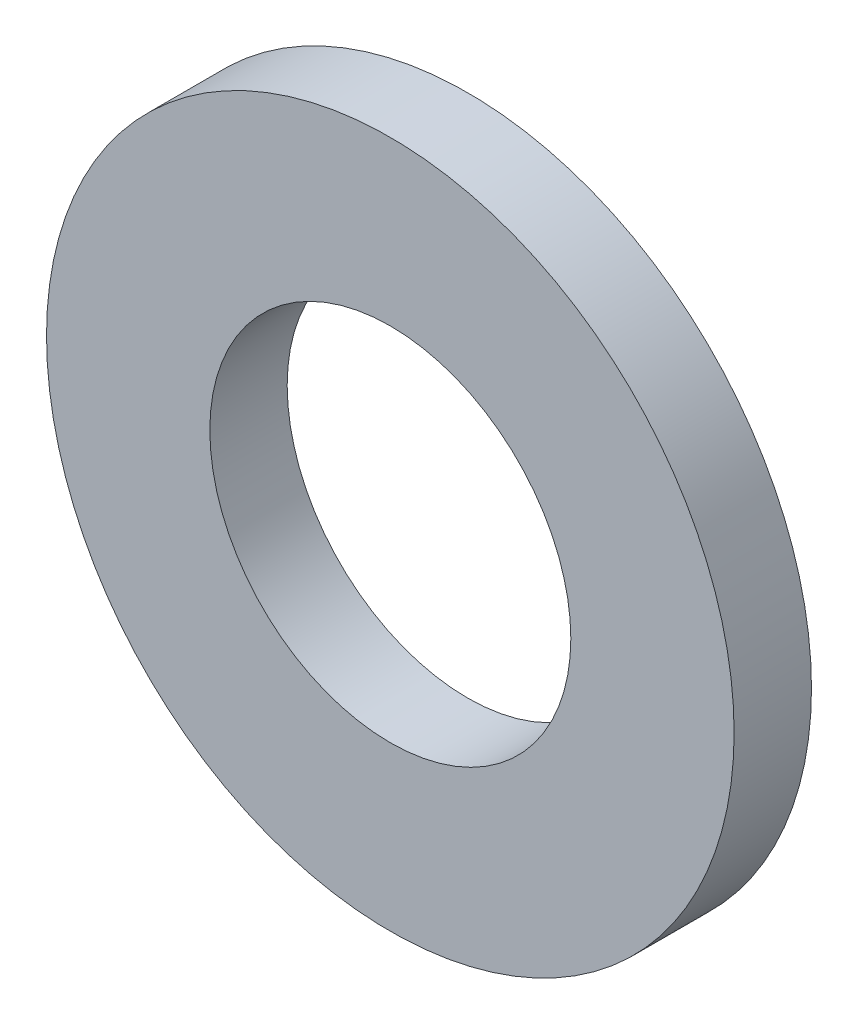
ISO-10303-21;
HEADER;
FILE_DESCRIPTION(('STEP AP214'),'2;1');
FILE_NAME('part.step','',(''),(''),'','','');
FILE_SCHEMA(('AUTOMOTIVE_DESIGN { 1 0 10303 214 1 1 1 1 }'));
ENDSEC;
DATA;
#1=APPLICATION_CONTEXT('core data for automotive mechanical design processes');
#2=APPLICATION_PROTOCOL_DEFINITION('international standard','automotive_design',2000,#1);
#3=PRODUCT_CONTEXT('',#1,'mechanical');
#4=PRODUCT('Part','Part','',(#3));
#5=PRODUCT_RELATED_PRODUCT_CATEGORY('part','',(#4));
#6=PRODUCT_DEFINITION_FORMATION('','',#4);
#7=PRODUCT_DEFINITION_CONTEXT('part definition',#1,'design');
#8=PRODUCT_DEFINITION('design','',#6,#7);
#9=PRODUCT_DEFINITION_SHAPE('','',#8);
#10=(LENGTH_UNIT() NAMED_UNIT(*) SI_UNIT(.MILLI.,.METRE.));
#11=(NAMED_UNIT(*) PLANE_ANGLE_UNIT() SI_UNIT($,.RADIAN.));
#12=(NAMED_UNIT(*) SI_UNIT($,.STERADIAN.) SOLID_ANGLE_UNIT());
#13=UNCERTAINTY_MEASURE_WITH_UNIT(LENGTH_MEASURE(1.E-05),#10,'distance_accuracy_value','');
#14=(GEOMETRIC_REPRESENTATION_CONTEXT(3) GLOBAL_UNCERTAINTY_ASSIGNED_CONTEXT((#13)) GLOBAL_UNIT_ASSIGNED_CONTEXT((#10,
#11,#12)) REPRESENTATION_CONTEXT('',''));
#15=CARTESIAN_POINT('',(0.,0.,0.));
#16=DIRECTION('',(0.,0.,1.));
#17=DIRECTION('',(1.,0.,0.));
#18=AXIS2_PLACEMENT_3D('',#15,#16,#17);
#19=CARTESIAN_POINT('',(0.,0.,0.));
#20=DIRECTION('',(0.,0.,1.));
#21=DIRECTION('',(1.,0.,0.));
#22=AXIS2_PLACEMENT_3D('',#19,#20,#21);
#23=PLANE('',#22);
#24=CARTESIAN_POINT('',(0.,0.,0.));
#25=DIRECTION('',(0.,0.,1.));
#26=DIRECTION('',(1.,0.,0.));
#27=AXIS2_PLACEMENT_3D('',#24,#25,#26);
#28=CIRCLE('',#27,4.2);
#29=CARTESIAN_POINT('',(4.2,0.,0.));
#30=VERTEX_POINT('',#29);
#31=EDGE_CURVE('E26',#30,#30,#28,.T.);
#32=ORIENTED_EDGE('',*,*,#31,.T.);
#33=EDGE_LOOP('',(#32));
#34=FACE_BOUND('',#33,.T.);
#35=CARTESIAN_POINT('',(0.,0.,0.));
#36=DIRECTION('',(0.,0.,1.));
#37=DIRECTION('',(1.,0.,0.));
#38=AXIS2_PLACEMENT_3D('',#35,#36,#37);
#39=CIRCLE('',#38,8.);
#40=CARTESIAN_POINT('',(8.,0.,0.));
#41=VERTEX_POINT('',#40);
#42=EDGE_CURVE('E17',#41,#41,#39,.T.);
#43=ORIENTED_EDGE('',*,*,#42,.F.);
#44=EDGE_LOOP('',(#43));
#45=FACE_BOUND('',#44,.T.);
#46=ADVANCED_FACE('F14',(#34,#45),#23,.F.);
#47=CARTESIAN_POINT('',(0.,0.,0.));
#48=DIRECTION('',(0.,0.,1.));
#49=DIRECTION('',(1.,0.,0.));
#50=AXIS2_PLACEMENT_3D('',#47,#48,#49);
#51=CYLINDRICAL_SURFACE('',#50,8.);
#52=ORIENTED_EDGE('',*,*,#42,.T.);
#53=EDGE_LOOP('',(#52));
#54=FACE_BOUND('',#53,.T.);
#55=CARTESIAN_POINT('',(0.,0.,1.8));
#56=DIRECTION('',(0.,0.,1.));
#57=DIRECTION('',(1.,0.,0.));
#58=AXIS2_PLACEMENT_3D('',#55,#56,#57);
#59=CIRCLE('',#58,8.);
#60=CARTESIAN_POINT('',(8.,0.,1.8));
#61=VERTEX_POINT('',#60);
#62=EDGE_CURVE('E21',#61,#61,#59,.T.);
#63=ORIENTED_EDGE('',*,*,#62,.F.);
#64=EDGE_LOOP('',(#63));
#65=FACE_BOUND('',#64,.T.);
#66=ADVANCED_FACE('F34',(#54,#65),#51,.T.);
#67=CARTESIAN_POINT('',(0.,0.,0.));
#68=DIRECTION('',(0.,0.,1.));
#69=DIRECTION('',(1.,0.,0.));
#70=AXIS2_PLACEMENT_3D('',#67,#68,#69);
#71=CYLINDRICAL_SURFACE('',#70,4.2);
#72=ORIENTED_EDGE('',*,*,#31,.F.);
#73=EDGE_LOOP('',(#72));
#74=FACE_BOUND('',#73,.T.);
#75=CARTESIAN_POINT('',(0.,0.,1.8));
#76=DIRECTION('',(0.,0.,1.));
#77=DIRECTION('',(1.,0.,0.));
#78=AXIS2_PLACEMENT_3D('',#75,#76,#77);
#79=CIRCLE('',#78,4.2);
#80=CARTESIAN_POINT('',(4.2,0.,1.8));
#81=VERTEX_POINT('',#80);
#82=EDGE_CURVE('E10',#81,#81,#79,.F.);
#83=ORIENTED_EDGE('',*,*,#82,.F.);
#84=EDGE_LOOP('',(#83));
#85=FACE_BOUND('',#84,.T.);
#86=ADVANCED_FACE('F42',(#74,#85),#71,.F.);
#87=CARTESIAN_POINT('',(0.,0.,1.8));
#88=DIRECTION('',(0.,0.,1.));
#89=DIRECTION('',(1.,0.,0.));
#90=AXIS2_PLACEMENT_3D('',#87,#88,#89);
#91=PLANE('',#90);
#92=ORIENTED_EDGE('',*,*,#82,.T.);
#93=EDGE_LOOP('',(#92));
#94=FACE_BOUND('',#93,.T.);
#95=ORIENTED_EDGE('',*,*,#62,.T.);
#96=EDGE_LOOP('',(#95));
#97=FACE_BOUND('',#96,.T.);
#98=ADVANCED_FACE('F43',(#94,#97),#91,.T.);
#99=CLOSED_SHELL('',(#46,#66,#86,#98));
#100=MANIFOLD_SOLID_BREP('B1',#99);
#101=ADVANCED_BREP_SHAPE_REPRESENTATION('',(#18,#100),#14);
#102=SHAPE_DEFINITION_REPRESENTATION(#9,#101);
ENDSEC;
END-ISO-10303-21;
